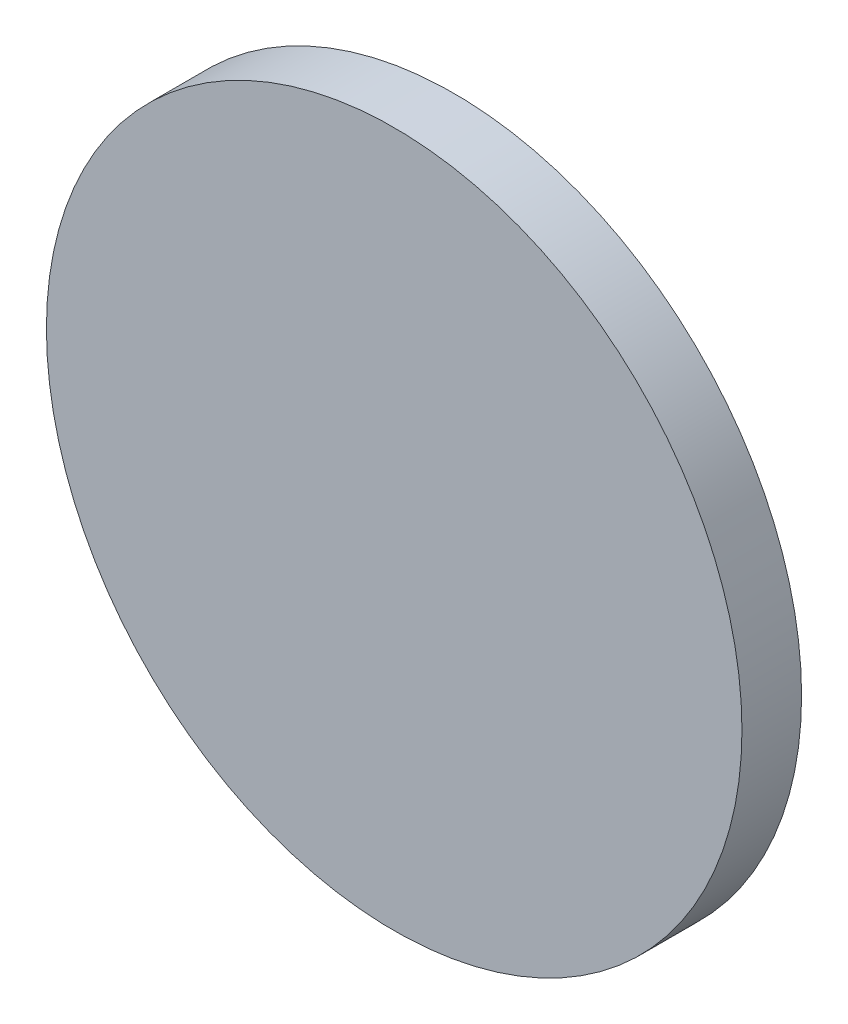
ISO-10303-21;
HEADER;
FILE_DESCRIPTION(('STEP AP214'),'2;1');
FILE_NAME('part.step','',(''),(''),'','','');
FILE_SCHEMA(('AUTOMOTIVE_DESIGN { 1 0 10303 214 1 1 1 1 }'));
ENDSEC;
DATA;
#1=APPLICATION_CONTEXT('core data for automotive mechanical design processes');
#2=APPLICATION_PROTOCOL_DEFINITION('international standard','automotive_design',2000,#1);
#3=PRODUCT_CONTEXT('',#1,'mechanical');
#4=PRODUCT('Part','Part','',(#3));
#5=PRODUCT_RELATED_PRODUCT_CATEGORY('part','',(#4));
#6=PRODUCT_DEFINITION_FORMATION('','',#4);
#7=PRODUCT_DEFINITION_CONTEXT('part definition',#1,'design');
#8=PRODUCT_DEFINITION('design','',#6,#7);
#9=PRODUCT_DEFINITION_SHAPE('','',#8);
#10=(LENGTH_UNIT() NAMED_UNIT(*) SI_UNIT(.MILLI.,.METRE.));
#11=(NAMED_UNIT(*) PLANE_ANGLE_UNIT() SI_UNIT($,.RADIAN.));
#12=(NAMED_UNIT(*) SI_UNIT($,.STERADIAN.) SOLID_ANGLE_UNIT());
#13=UNCERTAINTY_MEASURE_WITH_UNIT(LENGTH_MEASURE(1.E-05),#10,'distance_accuracy_value','');
#14=(GEOMETRIC_REPRESENTATION_CONTEXT(3) GLOBAL_UNCERTAINTY_ASSIGNED_CONTEXT((#13)) GLOBAL_UNIT_ASSIGNED_CONTEXT((#10,
#11,#12)) REPRESENTATION_CONTEXT('',''));
#15=CARTESIAN_POINT('',(0.,0.,0.));
#16=DIRECTION('',(0.,0.,1.));
#17=DIRECTION('',(1.,0.,0.));
#18=AXIS2_PLACEMENT_3D('',#15,#16,#17);
#19=CARTESIAN_POINT('',(2.19964,7.599680006176,0.));
#20=DIRECTION('',(0.,0.,-1.));
#21=DIRECTION('',(-1.,0.,0.));
#22=AXIS2_PLACEMENT_3D('',#19,#20,#21);
#23=PLANE('',#22);
#24=CARTESIAN_POINT('',(2.19964,7.599680006176,0.));
#25=DIRECTION('',(0.,0.,1.));
#26=DIRECTION('',(1.,0.,0.));
#27=AXIS2_PLACEMENT_3D('',#24,#25,#26);
#28=CIRCLE('',#27,0.200024667);
#29=CARTESIAN_POINT('',(2.399664667,7.599680006176,0.));
#30=VERTEX_POINT('',#29);
#31=EDGE_CURVE('E18',#30,#30,#28,.T.);
#32=ORIENTED_EDGE('',*,*,#31,.F.);
#33=EDGE_LOOP('',(#32));
#34=FACE_BOUND('',#33,.T.);
#35=ADVANCED_FACE('F15',(#34),#23,.T.);
#36=CARTESIAN_POINT('',(2.19964,7.599680006176,0.));
#37=DIRECTION('',(0.,0.,1.));
#38=DIRECTION('',(1.,0.,0.));
#39=AXIS2_PLACEMENT_3D('',#36,#37,#38);
#40=CYLINDRICAL_SURFACE('',#39,0.200024667);
#41=CARTESIAN_POINT('',(2.19964,7.599680006176,0.03429));
#42=DIRECTION('',(0.,0.,1.));
#43=DIRECTION('',(1.,0.,0.));
#44=AXIS2_PLACEMENT_3D('',#41,#42,#43);
#45=CIRCLE('',#44,0.200024667);
#46=CARTESIAN_POINT('',(2.399664667,7.599680006176,0.03429));
#47=VERTEX_POINT('',#46);
#48=EDGE_CURVE('E10',#47,#47,#45,.T.);
#49=ORIENTED_EDGE('',*,*,#48,.F.);
#50=EDGE_LOOP('',(#49));
#51=FACE_BOUND('',#50,.T.);
#52=ORIENTED_EDGE('',*,*,#31,.T.);
#53=EDGE_LOOP('',(#52));
#54=FACE_BOUND('',#53,.T.);
#55=ADVANCED_FACE('F27',(#51,#54),#40,.T.);
#56=CARTESIAN_POINT('',(2.19964,7.599680006176,0.03429));
#57=DIRECTION('',(0.,0.,1.));
#58=DIRECTION('',(1.,0.,0.));
#59=AXIS2_PLACEMENT_3D('',#56,#57,#58);
#60=PLANE('',#59);
#61=ORIENTED_EDGE('',*,*,#48,.T.);
#62=EDGE_LOOP('',(#61));
#63=FACE_BOUND('',#62,.T.);
#64=ADVANCED_FACE('F34',(#63),#60,.T.);
#65=CLOSED_SHELL('',(#35,#55,#64));
#66=MANIFOLD_SOLID_BREP('B1',#65);
#67=ADVANCED_BREP_SHAPE_REPRESENTATION('',(#18,#66),#14);
#68=SHAPE_DEFINITION_REPRESENTATION(#9,#67);
ENDSEC;
END-ISO-10303-21;
